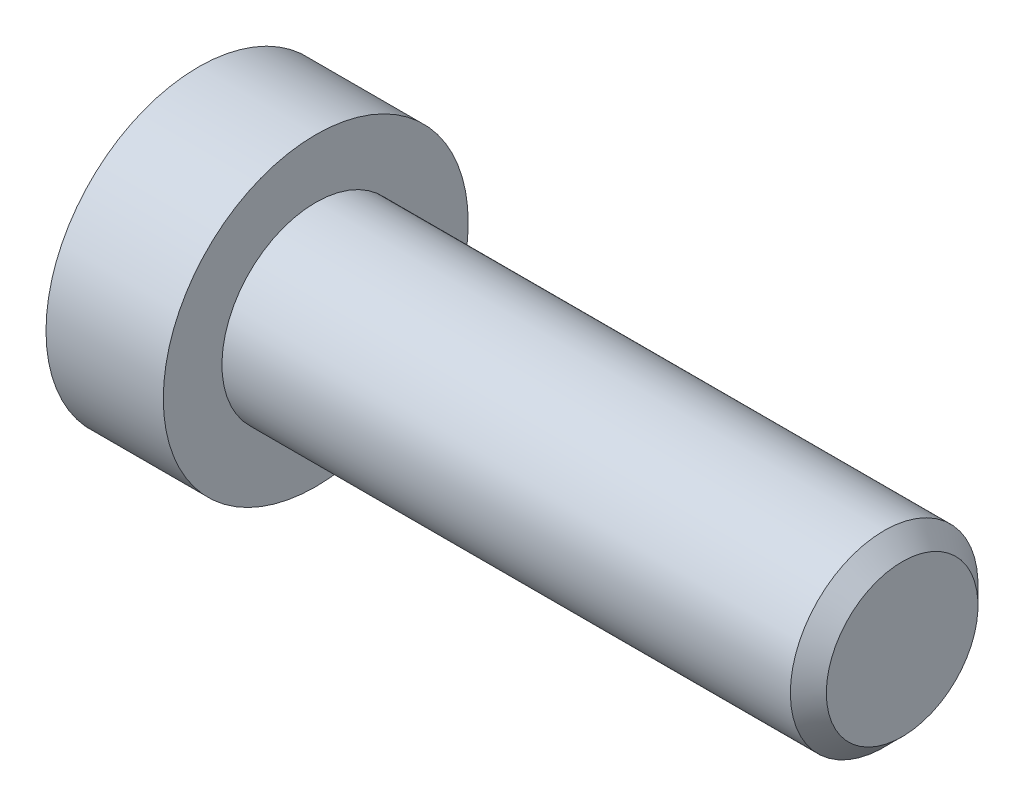
ISO-10303-21;
HEADER;
FILE_DESCRIPTION(('STEP AP214'),'2;1');
FILE_NAME('part.step','',(''),(''),'','','');
FILE_SCHEMA(('AUTOMOTIVE_DESIGN { 1 0 10303 214 1 1 1 1 }'));
ENDSEC;
DATA;
#1=APPLICATION_CONTEXT('core data for automotive mechanical design processes');
#2=APPLICATION_PROTOCOL_DEFINITION('international standard','automotive_design',2000,#1);
#3=PRODUCT_CONTEXT('',#1,'mechanical');
#4=PRODUCT('Part','Part','',(#3));
#5=PRODUCT_RELATED_PRODUCT_CATEGORY('part','',(#4));
#6=PRODUCT_DEFINITION_FORMATION('','',#4);
#7=PRODUCT_DEFINITION_CONTEXT('part definition',#1,'design');
#8=PRODUCT_DEFINITION('design','',#6,#7);
#9=PRODUCT_DEFINITION_SHAPE('','',#8);
#10=(LENGTH_UNIT() NAMED_UNIT(*) SI_UNIT(.MILLI.,.METRE.));
#11=(NAMED_UNIT(*) PLANE_ANGLE_UNIT() SI_UNIT($,.RADIAN.));
#12=(NAMED_UNIT(*) SI_UNIT($,.STERADIAN.) SOLID_ANGLE_UNIT());
#13=UNCERTAINTY_MEASURE_WITH_UNIT(LENGTH_MEASURE(1.E-05),#10,'distance_accuracy_value','');
#14=(GEOMETRIC_REPRESENTATION_CONTEXT(3) GLOBAL_UNCERTAINTY_ASSIGNED_CONTEXT((#13)) GLOBAL_UNIT_ASSIGNED_CONTEXT((#10,
#11,#12)) REPRESENTATION_CONTEXT('',''));
#15=CARTESIAN_POINT('',(0.,0.,0.));
#16=DIRECTION('',(0.,0.,1.));
#17=DIRECTION('',(1.,0.,0.));
#18=AXIS2_PLACEMENT_3D('',#15,#16,#17);
#19=CARTESIAN_POINT('',(1.4999999988845,0.,0.));
#20=DIRECTION('',(-1.,0.,0.));
#21=DIRECTION('',(0.,0.,1.));
#22=AXIS2_PLACEMENT_3D('',#19,#20,#21);
#23=CONICAL_SURFACE('',#22,1.9999999991569,1.04719754988149);
#24=CARTESIAN_POINT('',(2.65470054000616,-1.13686837721616E-10,0.));
#25=VERTEX_POINT('',#24);
#26=VERTEX_LOOP('',#25);
#27=FACE_BOUND('',#26,.T.);
#28=CARTESIAN_POINT('',(1.50000000000001,0.,0.));
#29=DIRECTION('',(1.,0.,0.));
#30=DIRECTION('',(0.,1.,0.));
#31=AXIS2_PLACEMENT_3D('',#28,#29,#30);
#32=CIRCLE('',#31,2.);
#33=CARTESIAN_POINT('',(1.50000000000001,2.,0.));
#34=VERTEX_POINT('',#33);
#35=EDGE_CURVE('E102',#34,#34,#32,.F.);
#36=ORIENTED_EDGE('',*,*,#35,.T.);
#37=EDGE_LOOP('',(#36));
#38=FACE_BOUND('',#37,.T.);
#39=ADVANCED_FACE('F15',(#27,#38),#23,.F.);
#40=CARTESIAN_POINT('',(0.172649730810379,0.,0.));
#41=DIRECTION('',(1.,0.,0.));
#42=DIRECTION('',(0.,1.,0.));
#43=AXIS2_PLACEMENT_3D('',#40,#41,#42);
#44=CYLINDRICAL_SURFACE('',#43,2.);
#45=ORIENTED_EDGE('',*,*,#35,.F.);
#46=EDGE_LOOP('',(#45));
#47=FACE_BOUND('',#46,.T.);
#48=CARTESIAN_POINT('',(-1.15470053748368,0.,0.));
#49=DIRECTION('',(-1.,0.,0.));
#50=DIRECTION('',(0.,1.,0.));
#51=AXIS2_PLACEMENT_3D('',#48,#49,#50);
#52=CIRCLE('',#51,2.0000000004643);
#53=CARTESIAN_POINT('',(-1.15470053748368,2.0000000004643,0.));
#54=VERTEX_POINT('',#53);
#55=EDGE_CURVE('E83',#54,#54,#52,.T.);
#56=ORIENTED_EDGE('',*,*,#55,.T.);
#57=EDGE_LOOP('',(#56));
#58=FACE_BOUND('',#57,.T.);
#59=ADVANCED_FACE('F152',(#47,#58),#44,.F.);
#60=CARTESIAN_POINT('',(-2.00507179761189,0.,0.));
#61=DIRECTION('',(-1.,0.,0.));
#62=DIRECTION('',(0.,0.,1.));
#63=AXIS2_PLACEMENT_3D('',#60,#61,#62);
#64=CONICAL_SURFACE('',#63,3.47288622424458,1.04719755000354);
#65=ORIENTED_EDGE('',*,*,#55,.F.);
#66=EDGE_LOOP('',(#65));
#67=FACE_BOUND('',#66,.T.);
#68=CARTESIAN_POINT('',(-2.00000000094557,3.00000000021538,1.73205080729591));
#69=CARTESIAN_POINT('',(-1.9560433185987,3.00000000007736,1.57982452062542));
#70=CARTESIAN_POINT('',(-1.91606701648317,3.00000000002074,1.42628421881986));
#71=CARTESIAN_POINT('',(-1.84628958176838,2.99999999997923,1.11654516758433));
#72=CARTESIAN_POINT('',(-1.81651313108637,2.9999999999945,0.960340916482288));
#73=CARTESIAN_POINT('',(-1.77016393888024,3.00000000000537,0.649868175264092));
#74=CARTESIAN_POINT('',(-1.75328268182428,3.00000000000144,0.495647441977665));
#75=CARTESIAN_POINT('',(-1.73313375260222,2.99999999999858,0.186480694490325));
#76=CARTESIAN_POINT('',(-1.72984939137745,2.99999999999965,0.0315358032554302));
#77=CARTESIAN_POINT('',(-1.73669943570568,3.00000000000032,-0.257962103818241));
#78=CARTESIAN_POINT('',(-1.74515192833178,3.00000000000009,-0.392558561177158));
#79=CARTESIAN_POINT('',(-1.77193595166592,2.99999999999992,-0.660874623875168));
#80=CARTESIAN_POINT('',(-1.79027662278917,2.99999999999998,-0.794593301873308));
#81=CARTESIAN_POINT('',(-1.83612475075242,3.00000000000003,-1.06346212096512));
#82=CARTESIAN_POINT('',(-1.86382646413472,3.00000000000002,-1.19857825024739));
#83=CARTESIAN_POINT('',(-1.92669764219973,2.99999999999999,-1.46679583459464));
#84=CARTESIAN_POINT('',(-1.96185234414,2.99999999999998,-1.59990072318624));
#85=CARTESIAN_POINT('',(-2.00000000108562,3.00000000000001,-1.7320508072926));
#86=B_SPLINE_CURVE_WITH_KNOTS('',3,(#68,#69,#70,#71,#72,#73,#74,#75,#76,#77,#78,#79,#80,#81,#82,
#83,#84,#85),.UNSPECIFIED.,.F.,.F.,(4,2,2,2,2,2,2,2,4),(0.,0.475524017494202,0.952190725870323,
1.41706140966825,1.88136133388909,2.28556167425684,2.69013629076999,3.10368243361385,
3.51641695995043),.UNSPECIFIED.);
#87=CARTESIAN_POINT('',(-2.00000000107572,2.99999999986554,1.73205080749124));
#88=VERTEX_POINT('',#87);
#89=CARTESIAN_POINT('',(-2.00000000112055,3.,-1.73205080741361));
#90=VERTEX_POINT('',#89);
#91=EDGE_CURVE('E18',#88,#90,#86,.T.);
#92=ORIENTED_EDGE('',*,*,#91,.T.);
#93=CARTESIAN_POINT('',(-2.00000000094557,2.99999999987129,-1.73205080789188));
#94=CARTESIAN_POINT('',(-1.9560433185987,2.86816816842187,-1.80816395110759));
#95=CARTESIAN_POINT('',(-1.91606701648317,2.73519836652522,-1.88493410196134));
#96=CARTESIAN_POINT('',(-1.84628958176838,2.4669564795904,-2.03980362754315));
#97=CARTESIAN_POINT('',(-1.81651313108636,2.33167962996455,-2.11790575310741));
#98=CARTESIAN_POINT('',(-1.77016393888024,2.06280234889243,-2.27314212372592));
#99=CARTESIAN_POINT('',(-1.75328268182428,1.92924327607415,-2.35025249036572));
#100=CARTESIAN_POINT('',(-1.73313375260221,1.66149701874328,-2.50483586410692));
#101=CARTESIAN_POINT('',(-1.72984939137744,1.52731080674778,-2.58230830972529));
#102=CARTESIAN_POINT('',(-1.73669943570568,1.27659826487989,-2.7270572632627));
#103=CARTESIAN_POINT('',(-1.74515192833178,1.16003431354756,-2.79435549194197));
#104=CARTESIAN_POINT('',(-1.77193595166592,0.927665787007584,-2.92851352329083));
#105=CARTESIAN_POINT('',(-1.79027662278917,0.811862014900753,-2.99537286228995));
#106=CARTESIAN_POINT('',(-1.83612475075242,0.579014787281745,-3.1298072718359));
#107=CARTESIAN_POINT('',(-1.86382646413472,0.462000786862266,-3.19736533647702));
#108=CARTESIAN_POINT('',(-1.92669764219973,0.229717545075842,-3.33147412865063));
#109=CARTESIAN_POINT('',(-1.96185234414,0.114445330187611,-3.39802657294642));
#110=CARTESIAN_POINT('',(-2.00000000108561,2.3927004015334E-10,-3.46410161499961));
#111=B_SPLINE_CURVE_WITH_KNOTS('',3,(#93,#94,#95,#96,#97,#98,#99,#100,#101,#102,#103,#104,#105,
#106,#107,#108,#109,#110),.UNSPECIFIED.,.F.,.F.,(4,2,2,2,2,2,2,2,4),(0.,0.475524017494201,
0.952190725870324,1.41706140966825,1.88136133388909,2.28556167425684,2.69013629076999,
3.10368243361386,3.51641695995044),.UNSPECIFIED.);
#112=CARTESIAN_POINT('',(-2.00000000107572,0.,-3.46410161498249));
#113=VERTEX_POINT('',#112);
#114=EDGE_CURVE('E107',#90,#113,#111,.T.);
#115=ORIENTED_EDGE('',*,*,#114,.T.);
#116=CARTESIAN_POINT('',(-2.00000000094557,-3.44076775760168E-10,-3.46410161518779));
#117=CARTESIAN_POINT('',(-1.9560433185987,-0.131831831655481,-3.38798847173302));
#118=CARTESIAN_POINT('',(-1.91606701648317,-0.264801633495514,-3.31121832078121));
#119=CARTESIAN_POINT('',(-1.84628958176838,-0.533043520388816,-3.15634879512749));
#120=CARTESIAN_POINT('',(-1.81651313108636,-0.668320370029949,-3.0782466695897));
#121=CARTESIAN_POINT('',(-1.77016393888024,-0.937197651112932,-2.92301029899001));
#122=CARTESIAN_POINT('',(-1.75328268182428,-1.07075672392727,-2.84589993234339));
#123=CARTESIAN_POINT('',(-1.73313375260221,-1.33850298125529,-2.69131655859725));
#124=CARTESIAN_POINT('',(-1.72984939137744,-1.47268919325186,-2.61384411298073));
#125=CARTESIAN_POINT('',(-1.73669943570568,-1.72340173512042,-2.46909515944447));
#126=CARTESIAN_POINT('',(-1.74515192833178,-1.83996568645252,-2.40179693076482));
#127=CARTESIAN_POINT('',(-1.77193595166592,-2.07233421299233,-2.26763889941566));
#128=CARTESIAN_POINT('',(-1.79027662278916,-2.18813798509922,-2.20077956041665));
#129=CARTESIAN_POINT('',(-1.83612475075242,-2.42098521271828,-2.06634515087078));
#130=CARTESIAN_POINT('',(-1.86382646413472,-2.53799921313775,-1.99878708622963));
#131=CARTESIAN_POINT('',(-1.92669764219973,-2.77028245492415,-1.86467829405599));
#132=CARTESIAN_POINT('',(-1.96185234414,-2.88555466981237,-1.79812584976018));
#133=CARTESIAN_POINT('',(-2.00000000108561,-2.99999999976073,-1.73205080770702));
#134=B_SPLINE_CURVE_WITH_KNOTS('',3,(#116,#117,#118,#119,#120,#121,#122,#123,#124,#125,#126,
#127,#128,#129,#130,#131,#132,#133),.UNSPECIFIED.,.F.,.F.,(4,2,2,2,2,2,2,2,4),(0.,
0.475524017494202,0.952190725870323,1.41706140966825,1.88136133388909,2.28556167425684,
2.69013629076999,3.10368243361386,3.51641695995044),.UNSPECIFIED.);
#135=CARTESIAN_POINT('',(-2.00000000107572,-2.99999999986553,-1.73205080749124));
#136=VERTEX_POINT('',#135);
#137=EDGE_CURVE('E141',#113,#136,#134,.T.);
#138=ORIENTED_EDGE('',*,*,#137,.T.);
#139=CARTESIAN_POINT('',(-2.00000000094557,-3.00000000021537,-1.73205080729591));
#140=CARTESIAN_POINT('',(-1.9560433185987,-3.00000000007735,-1.57982452062543));
#141=CARTESIAN_POINT('',(-1.91606701648317,-3.00000000002073,-1.42628421881987));
#142=CARTESIAN_POINT('',(-1.84628958176838,-2.99999999997922,-1.11654516758434));
#143=CARTESIAN_POINT('',(-1.81651313108636,-2.9999999999945,-0.960340916482298));
#144=CARTESIAN_POINT('',(-1.77016393888024,-3.00000000000537,-0.649868175264101));
#145=CARTESIAN_POINT('',(-1.75328268182428,-3.00000000000143,-0.495647441977675));
#146=CARTESIAN_POINT('',(-1.73313375260221,-2.99999999999857,-0.186480694490335));
#147=CARTESIAN_POINT('',(-1.72984939137744,-2.99999999999964,-0.0315358032554405));
#148=CARTESIAN_POINT('',(-1.73669943570568,-3.00000000000031,0.257962103818231));
#149=CARTESIAN_POINT('',(-1.74515192833178,-3.00000000000008,0.392558561177148));
#150=CARTESIAN_POINT('',(-1.77193595166592,-2.99999999999992,0.66087462387516));
#151=CARTESIAN_POINT('',(-1.79027662278916,-2.99999999999998,0.794593301873301));
#152=CARTESIAN_POINT('',(-1.83612475075242,-3.00000000000002,1.06346212096511));
#153=CARTESIAN_POINT('',(-1.86382646413472,-3.00000000000001,1.19857825024739));
#154=CARTESIAN_POINT('',(-1.92669764219973,-2.99999999999999,1.46679583459464));
#155=CARTESIAN_POINT('',(-1.96185234414,-2.99999999999998,1.59990072318624));
#156=CARTESIAN_POINT('',(-2.00000000108561,-3.,1.7320508072926));
#157=B_SPLINE_CURVE_WITH_KNOTS('',3,(#139,#140,#141,#142,#143,#144,#145,#146,#147,#148,#149,
#150,#151,#152,#153,#154,#155,#156),.UNSPECIFIED.,.F.,.F.,(4,2,2,2,2,2,2,2,4),(0.,
0.475524017494202,0.952190725870323,1.41706140966825,1.88136133388909,2.28556167425684,
2.69013629076999,3.10368243361386,3.51641695995044),.UNSPECIFIED.);
#158=CARTESIAN_POINT('',(-2.00000000107572,-2.99999999986553,1.73205080749124));
#159=VERTEX_POINT('',#158);
#160=EDGE_CURVE('E165',#136,#159,#157,.T.);
#161=ORIENTED_EDGE('',*,*,#160,.T.);
#162=CARTESIAN_POINT('',(-2.00000000094557,-2.99999999987129,1.73205080789188));
#163=CARTESIAN_POINT('',(-1.9560433185987,-2.86816816842187,1.80816395110759));
#164=CARTESIAN_POINT('',(-1.91606701648317,-2.73519836652522,1.88493410196134));
#165=CARTESIAN_POINT('',(-1.84628958176838,-2.4669564795904,2.03980362754315));
#166=CARTESIAN_POINT('',(-1.81651313108636,-2.33167962996455,2.1179057531074));
#167=CARTESIAN_POINT('',(-1.77016393888024,-2.06280234889243,2.27314212372591));
#168=CARTESIAN_POINT('',(-1.75328268182428,-1.92924327607415,2.35025249036572));
#169=CARTESIAN_POINT('',(-1.73313375260221,-1.66149701874328,2.50483586410691));
#170=CARTESIAN_POINT('',(-1.72984939137744,-1.52731080674778,2.58230830972529));
#171=CARTESIAN_POINT('',(-1.73669943570568,-1.27659826487989,2.7270572632627));
#172=CARTESIAN_POINT('',(-1.74515192833178,-1.16003431354756,2.79435549194196));
#173=CARTESIAN_POINT('',(-1.77193595166592,-0.927665787007583,2.92851352329082));
#174=CARTESIAN_POINT('',(-1.79027662278917,-0.811862014900752,2.99537286228995));
#175=CARTESIAN_POINT('',(-1.83612475075242,-0.579014787281744,3.1298072718359));
#176=CARTESIAN_POINT('',(-1.86382646413472,-0.462000786862265,3.19736533647702));
#177=CARTESIAN_POINT('',(-1.92669764219973,-0.22971754507584,3.33147412865062));
#178=CARTESIAN_POINT('',(-1.96185234414,-0.114445330187609,3.39802657294641));
#179=CARTESIAN_POINT('',(-2.00000000108561,-2.3926765252975E-10,3.46410161499961));
#180=B_SPLINE_CURVE_WITH_KNOTS('',3,(#162,#163,#164,#165,#166,#167,#168,#169,#170,#171,#172,
#173,#174,#175,#176,#177,#178,#179),.UNSPECIFIED.,.F.,.F.,(4,2,2,2,2,2,2,2,4),(0.,
0.475524017494202,0.952190725870323,1.41706140966825,1.88136133388909,2.28556167425684,
2.69013629076999,3.10368243361386,3.51641695995044),.UNSPECIFIED.);
#181=CARTESIAN_POINT('',(-2.00000000107572,0.,3.46410161498249));
#182=VERTEX_POINT('',#181);
#183=EDGE_CURVE('E88',#159,#182,#180,.T.);
#184=ORIENTED_EDGE('',*,*,#183,.T.);
#185=CARTESIAN_POINT('',(-2.00000000094557,3.4407826201377E-10,3.46410161518779));
#186=CARTESIAN_POINT('',(-1.9560433185987,0.131831831655483,3.38798847173302));
#187=CARTESIAN_POINT('',(-1.91606701648317,0.264801633495515,3.3112183207812));
#188=CARTESIAN_POINT('',(-1.84628958176838,0.533043520388817,3.15634879512749));
#189=CARTESIAN_POINT('',(-1.81651313108636,0.668320370029949,3.0782466695897));
#190=CARTESIAN_POINT('',(-1.77016393888023,0.937197651112932,2.92301029899001));
#191=CARTESIAN_POINT('',(-1.75328268182428,1.07075672392727,2.84589993234339));
#192=CARTESIAN_POINT('',(-1.73313375260221,1.33850298125529,2.69131655859724));
#193=CARTESIAN_POINT('',(-1.72984939137744,1.47268919325186,2.61384411298072));
#194=CARTESIAN_POINT('',(-1.73669943570568,1.72340173512042,2.46909515944447));
#195=CARTESIAN_POINT('',(-1.74515192833178,1.83996568645252,2.40179693076481));
#196=CARTESIAN_POINT('',(-1.77193595166592,2.07233421299233,2.26763889941566));
#197=CARTESIAN_POINT('',(-1.79027662278916,2.18813798509922,2.20077956041664));
#198=CARTESIAN_POINT('',(-1.83612475075241,2.42098521271828,2.06634515087078));
#199=CARTESIAN_POINT('',(-1.86382646413472,2.53799921313775,1.99878708622963));
#200=CARTESIAN_POINT('',(-1.92669764219973,2.77028245492415,1.86467829405598));
#201=CARTESIAN_POINT('',(-1.96185234414,2.88555466981237,1.79812584976017));
#202=CARTESIAN_POINT('',(-2.00000000108561,2.99999999976074,1.73205080770701));
#203=B_SPLINE_CURVE_WITH_KNOTS('',3,(#185,#186,#187,#188,#189,#190,#191,#192,#193,#194,#195,
#196,#197,#198,#199,#200,#201,#202),.UNSPECIFIED.,.F.,.F.,(4,2,2,2,2,2,2,2,4),(0.,
0.475524017494201,0.952190725870322,1.41706140966825,1.88136133388909,2.28556167425684,
2.69013629076999,3.10368243361386,3.51641695995045),.UNSPECIFIED.);
#204=EDGE_CURVE('E85',#182,#88,#203,.T.);
#205=ORIENTED_EDGE('',*,*,#204,.T.);
#206=EDGE_LOOP('',(#92,#115,#138,#161,#184,#205));
#207=FACE_BOUND('',#206,.T.);
#208=ADVANCED_FACE('F86',(#67,#207),#64,.F.);
#209=CARTESIAN_POINT('',(-5.,3.00000000000001,1.73205080756887));
#210=DIRECTION('',(0.,1.,0.));
#211=DIRECTION('',(0.,0.,1.));
#212=AXIS2_PLACEMENT_3D('',#209,#210,#211);
#213=PLANE('',#212);
#214=DIRECTION('',(1.,0.,0.));
#215=VECTOR('',#214,1.);
#216=CARTESIAN_POINT('',(-5.,3.,1.73205080756887));
#217=LINE('',#216,#215);
#218=CARTESIAN_POINT('',(-5.,3.,1.73205080756887));
#219=VERTEX_POINT('',#218);
#220=EDGE_CURVE('E76',#88,#219,#217,.F.);
#221=ORIENTED_EDGE('',*,*,#220,.T.);
#222=DIRECTION('',(0.,0.,1.));
#223=VECTOR('',#222,1.);
#224=CARTESIAN_POINT('',(-5.,3.,0.));
#225=LINE('',#224,#223);
#226=CARTESIAN_POINT('',(-5.,3.,-1.73205080756888));
#227=VERTEX_POINT('',#226);
#228=EDGE_CURVE('E105',#227,#219,#225,.T.);
#229=ORIENTED_EDGE('',*,*,#228,.F.);
#230=DIRECTION('',(1.,0.,0.));
#231=VECTOR('',#230,1.);
#232=CARTESIAN_POINT('',(-5.,3.,-1.73205080756888));
#233=LINE('',#232,#231);
#234=EDGE_CURVE('E79',#227,#90,#233,.T.);
#235=ORIENTED_EDGE('',*,*,#234,.T.);
#236=ORIENTED_EDGE('',*,*,#91,.F.);
#237=EDGE_LOOP('',(#221,#229,#235,#236));
#238=FACE_BOUND('',#237,.T.);
#239=ADVANCED_FACE('F73',(#238),#213,.F.);
#240=CARTESIAN_POINT('',(-5.,0.,3.46410161513775));
#241=DIRECTION('',(0.,0.500000000000001,0.866025403784438));
#242=DIRECTION('',(0.,-0.866025403784438,0.500000000000001));
#243=AXIS2_PLACEMENT_3D('',#240,#241,#242);
#244=PLANE('',#243);
#245=DIRECTION('',(1.,0.,0.));
#246=VECTOR('',#245,1.);
#247=CARTESIAN_POINT('',(-5.,0.,3.46410161513775));
#248=LINE('',#247,#246);
#249=CARTESIAN_POINT('',(-5.,0.,3.46410161513775));
#250=VERTEX_POINT('',#249);
#251=EDGE_CURVE('E91',#182,#250,#248,.F.);
#252=ORIENTED_EDGE('',*,*,#251,.T.);
#253=DIRECTION('',(0.,-0.866025403784438,0.500000000000001));
#254=VECTOR('',#253,1.);
#255=CARTESIAN_POINT('',(-5.,3.00000000000001,1.73205080756887));
#256=LINE('',#255,#254);
#257=EDGE_CURVE('E94',#219,#250,#256,.T.);
#258=ORIENTED_EDGE('',*,*,#257,.F.);
#259=ORIENTED_EDGE('',*,*,#220,.F.);
#260=ORIENTED_EDGE('',*,*,#204,.F.);
#261=EDGE_LOOP('',(#252,#258,#259,#260));
#262=FACE_BOUND('',#261,.T.);
#263=ADVANCED_FACE('F92',(#262),#244,.F.);
#264=CARTESIAN_POINT('',(-5.,-3.,1.73205080756888));
#265=DIRECTION('',(0.,-0.5,0.866025403784439));
#266=DIRECTION('',(0.,-0.866025403784439,-0.5));
#267=AXIS2_PLACEMENT_3D('',#264,#265,#266);
#268=PLANE('',#267);
#269=DIRECTION('',(1.,0.,0.));
#270=VECTOR('',#269,1.);
#271=CARTESIAN_POINT('',(-5.,-3.,1.73205080756888));
#272=LINE('',#271,#270);
#273=CARTESIAN_POINT('',(-5.,-3.,1.73205080756888));
#274=VERTEX_POINT('',#273);
#275=EDGE_CURVE('E174',#159,#274,#272,.F.);
#276=ORIENTED_EDGE('',*,*,#275,.T.);
#277=DIRECTION('',(0.,-0.866025403784439,-0.5));
#278=VECTOR('',#277,1.);
#279=CARTESIAN_POINT('',(-5.,0.,3.46410161513775));
#280=LINE('',#279,#278);
#281=EDGE_CURVE('E118',#250,#274,#280,.T.);
#282=ORIENTED_EDGE('',*,*,#281,.F.);
#283=ORIENTED_EDGE('',*,*,#251,.F.);
#284=ORIENTED_EDGE('',*,*,#183,.F.);
#285=EDGE_LOOP('',(#276,#282,#283,#284));
#286=FACE_BOUND('',#285,.T.);
#287=ADVANCED_FACE('F175',(#286),#268,.F.);
#288=CARTESIAN_POINT('',(-5.,-3.,-1.73205080756888));
#289=DIRECTION('',(0.,-1.,0.));
#290=DIRECTION('',(0.,0.,-1.));
#291=AXIS2_PLACEMENT_3D('',#288,#289,#290);
#292=PLANE('',#291);
#293=DIRECTION('',(1.,0.,0.));
#294=VECTOR('',#293,1.);
#295=CARTESIAN_POINT('',(-5.,-3.,-1.73205080756888));
#296=LINE('',#295,#294);
#297=CARTESIAN_POINT('',(-5.,-3.,-1.73205080756888));
#298=VERTEX_POINT('',#297);
#299=EDGE_CURVE('E226',#136,#298,#296,.F.);
#300=ORIENTED_EDGE('',*,*,#299,.T.);
#301=DIRECTION('',(0.,0.,1.));
#302=VECTOR('',#301,1.);
#303=CARTESIAN_POINT('',(-5.,-3.,0.));
#304=LINE('',#303,#302);
#305=EDGE_CURVE('E115',#274,#298,#304,.F.);
#306=ORIENTED_EDGE('',*,*,#305,.F.);
#307=ORIENTED_EDGE('',*,*,#275,.F.);
#308=ORIENTED_EDGE('',*,*,#160,.F.);
#309=EDGE_LOOP('',(#300,#306,#307,#308));
#310=FACE_BOUND('',#309,.T.);
#311=ADVANCED_FACE('F178',(#310),#292,.F.);
#312=CARTESIAN_POINT('',(-5.,0.,-3.46410161513775));
#313=DIRECTION('',(0.,-0.5,-0.866025403784439));
#314=DIRECTION('',(0.,0.866025403784439,-0.5));
#315=AXIS2_PLACEMENT_3D('',#312,#313,#314);
#316=PLANE('',#315);
#317=DIRECTION('',(1.,0.,0.));
#318=VECTOR('',#317,1.);
#319=CARTESIAN_POINT('',(-5.,0.,-3.46410161513776));
#320=LINE('',#319,#318);
#321=CARTESIAN_POINT('',(-5.,0.,-3.46410161513776));
#322=VERTEX_POINT('',#321);
#323=EDGE_CURVE('E38',#113,#322,#320,.F.);
#324=ORIENTED_EDGE('',*,*,#323,.T.);
#325=DIRECTION('',(0.,0.866025403784439,-0.5));
#326=VECTOR('',#325,1.);
#327=CARTESIAN_POINT('',(-5.,-3.,-1.73205080756888));
#328=LINE('',#327,#326);
#329=EDGE_CURVE('E112',#298,#322,#328,.T.);
#330=ORIENTED_EDGE('',*,*,#329,.F.);
#331=ORIENTED_EDGE('',*,*,#299,.F.);
#332=ORIENTED_EDGE('',*,*,#137,.F.);
#333=EDGE_LOOP('',(#324,#330,#331,#332));
#334=FACE_BOUND('',#333,.T.);
#335=ADVANCED_FACE('F217',(#334),#316,.F.);
#336=CARTESIAN_POINT('',(-5.,3.,-1.73205080756888));
#337=DIRECTION('',(0.,0.5,-0.866025403784439));
#338=DIRECTION('',(0.,0.866025403784439,0.5));
#339=AXIS2_PLACEMENT_3D('',#336,#337,#338);
#340=PLANE('',#339);
#341=ORIENTED_EDGE('',*,*,#234,.F.);
#342=DIRECTION('',(0.,0.866025403784439,0.499999999999999));
#343=VECTOR('',#342,1.);
#344=CARTESIAN_POINT('',(-5.,0.,-3.46410161513775));
#345=LINE('',#344,#343);
#346=EDGE_CURVE('E108',#322,#227,#345,.T.);
#347=ORIENTED_EDGE('',*,*,#346,.F.);
#348=ORIENTED_EDGE('',*,*,#323,.F.);
#349=ORIENTED_EDGE('',*,*,#114,.F.);
#350=EDGE_LOOP('',(#341,#347,#348,#349));
#351=FACE_BOUND('',#350,.T.);
#352=ADVANCED_FACE('F147',(#351),#340,.F.);
#353=CARTESIAN_POINT('',(-5.,4.98205080756888,0.));
#354=DIRECTION('',(-1.,0.,0.));
#355=DIRECTION('',(0.,0.,1.));
#356=AXIS2_PLACEMENT_3D('',#353,#354,#355);
#357=PLANE('',#356);
#358=ORIENTED_EDGE('',*,*,#329,.T.);
#359=ORIENTED_EDGE('',*,*,#346,.T.);
#360=ORIENTED_EDGE('',*,*,#228,.T.);
#361=ORIENTED_EDGE('',*,*,#257,.T.);
#362=ORIENTED_EDGE('',*,*,#281,.T.);
#363=ORIENTED_EDGE('',*,*,#305,.T.);
#364=EDGE_LOOP('',(#358,#359,#360,#361,#362,#363));
#365=FACE_BOUND('',#364,.T.);
#366=CARTESIAN_POINT('',(-5.,0.,0.));
#367=DIRECTION('',(1.,0.,0.));
#368=DIRECTION('',(0.,1.,0.));
#369=AXIS2_PLACEMENT_3D('',#366,#367,#368);
#370=CIRCLE('',#369,6.5);
#371=CARTESIAN_POINT('',(-5.,6.5,0.));
#372=VERTEX_POINT('',#371);
#373=EDGE_CURVE('E111',#372,#372,#370,.T.);
#374=ORIENTED_EDGE('',*,*,#373,.F.);
#375=EDGE_LOOP('',(#374));
#376=FACE_BOUND('',#375,.T.);
#377=ADVANCED_FACE('F210',(#365,#376),#357,.T.);
#378=CARTESIAN_POINT('',(-2.5,0.,0.));
#379=DIRECTION('',(1.,0.,0.));
#380=DIRECTION('',(0.,1.,0.));
#381=AXIS2_PLACEMENT_3D('',#378,#379,#380);
#382=CYLINDRICAL_SURFACE('',#381,6.5);
#383=ORIENTED_EDGE('',*,*,#373,.T.);
#384=EDGE_LOOP('',(#383));
#385=FACE_BOUND('',#384,.T.);
#386=CARTESIAN_POINT('',(0.,0.,0.));
#387=DIRECTION('',(1.,0.,0.));
#388=DIRECTION('',(0.,1.,0.));
#389=AXIS2_PLACEMENT_3D('',#386,#387,#388);
#390=CIRCLE('',#389,6.5);
#391=CARTESIAN_POINT('',(0.,6.5,0.));
#392=VERTEX_POINT('',#391);
#393=EDGE_CURVE('E131',#392,#392,#390,.T.);
#394=ORIENTED_EDGE('',*,*,#393,.F.);
#395=EDGE_LOOP('',(#394));
#396=FACE_BOUND('',#395,.T.);
#397=ADVANCED_FACE('F207',(#385,#396),#382,.T.);
#398=CARTESIAN_POINT('',(25.,2.,0.));
#399=DIRECTION('',(1.,0.,0.));
#400=DIRECTION('',(0.,0.,-1.));
#401=AXIS2_PLACEMENT_3D('',#398,#399,#400);
#402=PLANE('',#401);
#403=CARTESIAN_POINT('',(25.0000000003183,0.,0.));
#404=DIRECTION('',(-1.,0.,0.));
#405=DIRECTION('',(0.,0.,1.));
#406=AXIS2_PLACEMENT_3D('',#403,#404,#405);
#407=CIRCLE('',#406,3.2331875003706);
#408=CARTESIAN_POINT('',(25.0000000003183,0.,3.2331875003706));
#409=VERTEX_POINT('',#408);
#410=EDGE_CURVE('E128',#409,#409,#407,.T.);
#411=ORIENTED_EDGE('',*,*,#410,.F.);
#412=EDGE_LOOP('',(#411));
#413=FACE_BOUND('',#412,.T.);
#414=ADVANCED_FACE('F203',(#413),#402,.T.);
#415=CARTESIAN_POINT('',(0.,5.25,0.));
#416=DIRECTION('',(1.,0.,0.));
#417=DIRECTION('',(0.,0.,-1.));
#418=AXIS2_PLACEMENT_3D('',#415,#416,#417);
#419=PLANE('',#418);
#420=CARTESIAN_POINT('',(0.,0.,0.));
#421=DIRECTION('',(1.,0.,0.));
#422=DIRECTION('',(0.,1.,0.));
#423=AXIS2_PLACEMENT_3D('',#420,#421,#422);
#424=CIRCLE('',#423,4.);
#425=CARTESIAN_POINT('',(0.,4.,0.));
#426=VERTEX_POINT('',#425);
#427=EDGE_CURVE('E29',#426,#426,#424,.T.);
#428=ORIENTED_EDGE('',*,*,#427,.F.);
#429=EDGE_LOOP('',(#428));
#430=FACE_BOUND('',#429,.T.);
#431=ORIENTED_EDGE('',*,*,#393,.T.);
#432=EDGE_LOOP('',(#431));
#433=FACE_BOUND('',#432,.T.);
#434=ADVANCED_FACE('F196',(#430,#433),#419,.T.);
#435=CARTESIAN_POINT('',(24.2331874997035,0.,0.));
#436=DIRECTION('',(-1.,0.,0.));
#437=DIRECTION('',(0.,0.,1.));
#438=AXIS2_PLACEMENT_3D('',#435,#436,#437);
#439=CONICAL_SURFACE('',#438,3.99999999956435,0.78539816247083);
#440=ORIENTED_EDGE('',*,*,#410,.T.);
#441=EDGE_LOOP('',(#440));
#442=FACE_BOUND('',#441,.T.);
#443=CARTESIAN_POINT('',(24.2331875,0.,0.));
#444=DIRECTION('',(1.,0.,0.));
#445=DIRECTION('',(0.,1.,0.));
#446=AXIS2_PLACEMENT_3D('',#443,#444,#445);
#447=CIRCLE('',#446,4.);
#448=CARTESIAN_POINT('',(24.2331875,4.,0.));
#449=VERTEX_POINT('',#448);
#450=EDGE_CURVE('E9',#449,#449,#447,.F.);
#451=ORIENTED_EDGE('',*,*,#450,.F.);
#452=EDGE_LOOP('',(#451));
#453=FACE_BOUND('',#452,.T.);
#454=ADVANCED_FACE('F189',(#442,#453),#439,.T.);
#455=CARTESIAN_POINT('',(12.5,0.,0.));
#456=DIRECTION('',(1.,0.,0.));
#457=DIRECTION('',(0.,1.,0.));
#458=AXIS2_PLACEMENT_3D('',#455,#456,#457);
#459=CYLINDRICAL_SURFACE('',#458,4.);
#460=ORIENTED_EDGE('',*,*,#450,.T.);
#461=EDGE_LOOP('',(#460));
#462=FACE_BOUND('',#461,.T.);
#463=ORIENTED_EDGE('',*,*,#427,.T.);
#464=EDGE_LOOP('',(#463));
#465=FACE_BOUND('',#464,.T.);
#466=ADVANCED_FACE('F187',(#462,#465),#459,.T.);
#467=CLOSED_SHELL('',(#39,#59,#208,#239,#263,#287,#311,#335,#352,#377,#397,#414,#434,#454,#466));
#468=MANIFOLD_SOLID_BREP('B1',#467);
#469=ADVANCED_BREP_SHAPE_REPRESENTATION('',(#18,#468),#14);
#470=SHAPE_DEFINITION_REPRESENTATION(#9,#469);
ENDSEC;
END-ISO-10303-21;
